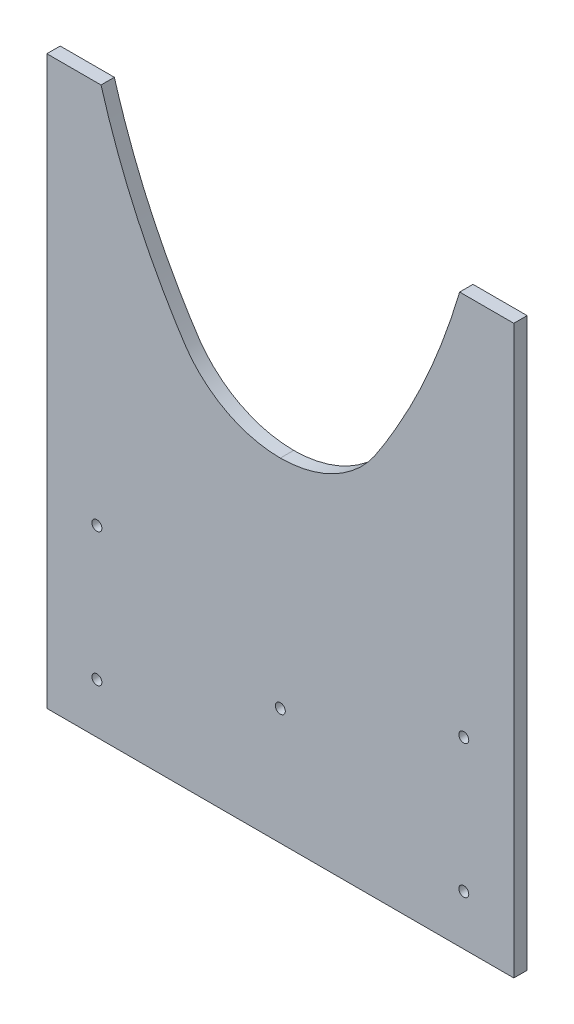
ISO-10303-21;
HEADER;
FILE_DESCRIPTION(('STEP AP214'),'2;1');
FILE_NAME('part.step','',(''),(''),'','','');
FILE_SCHEMA(('AUTOMOTIVE_DESIGN { 1 0 10303 214 1 1 1 1 }'));
ENDSEC;
DATA;
#1=APPLICATION_CONTEXT('core data for automotive mechanical design processes');
#2=APPLICATION_PROTOCOL_DEFINITION('international standard','automotive_design',2000,#1);
#3=PRODUCT_CONTEXT('',#1,'mechanical');
#4=PRODUCT('Part','Part','',(#3));
#5=PRODUCT_RELATED_PRODUCT_CATEGORY('part','',(#4));
#6=PRODUCT_DEFINITION_FORMATION('','',#4);
#7=PRODUCT_DEFINITION_CONTEXT('part definition',#1,'design');
#8=PRODUCT_DEFINITION('design','',#6,#7);
#9=PRODUCT_DEFINITION_SHAPE('','',#8);
#10=(LENGTH_UNIT() NAMED_UNIT(*) SI_UNIT(.MILLI.,.METRE.));
#11=(NAMED_UNIT(*) PLANE_ANGLE_UNIT() SI_UNIT($,.RADIAN.));
#12=(NAMED_UNIT(*) SI_UNIT($,.STERADIAN.) SOLID_ANGLE_UNIT());
#13=UNCERTAINTY_MEASURE_WITH_UNIT(LENGTH_MEASURE(1.E-05),#10,'distance_accuracy_value','');
#14=(GEOMETRIC_REPRESENTATION_CONTEXT(3) GLOBAL_UNCERTAINTY_ASSIGNED_CONTEXT((#13)) GLOBAL_UNIT_ASSIGNED_CONTEXT((#10,
#11,#12)) REPRESENTATION_CONTEXT('',''));
#15=CARTESIAN_POINT('',(0.,0.,0.));
#16=DIRECTION('',(0.,0.,1.));
#17=DIRECTION('',(1.,0.,0.));
#18=AXIS2_PLACEMENT_3D('',#15,#16,#17);
#19=CARTESIAN_POINT('',(68.2776648384723,-76.2788164399899,1785.62));
#20=CARTESIAN_POINT('',(66.3580377716615,-82.809925819806,1785.62));
#21=CARTESIAN_POINT('',(64.1931728528322,-89.2930332015323,1785.62));
#22=CARTESIAN_POINT('',(61.0505925062542,-97.6520891564207,1785.62));
#23=CARTESIAN_POINT('',(60.3031566909286,-99.5750173457487,1785.62));
#24=CARTESIAN_POINT('',(58.7656954371436,-103.402745234526,1785.62));
#25=CARTESIAN_POINT('',(57.9779989588845,-105.307253065276,1785.62));
#26=CARTESIAN_POINT('',(55.5359874824274,-110.98184323593,1785.62));
#27=CARTESIAN_POINT('',(53.8110889481545,-114.717105752996,1785.62));
#28=CARTESIAN_POINT('',(50.1870863601385,-122.101692823934,1785.62));
#29=CARTESIAN_POINT('',(48.2864949272062,-125.750283633326,1785.62));
#30=CARTESIAN_POINT('',(45.3042831918309,-131.158385634661,1785.62));
#31=CARTESIAN_POINT('',(44.2887270005921,-132.950487155397,1785.62));
#32=CARTESIAN_POINT('',(42.2117934578612,-136.51208599239,1785.62));
#33=CARTESIAN_POINT('',(41.151561944254,-138.283463920776,1785.62));
#34=CARTESIAN_POINT('',(38.9901136188299,-141.791224850873,1785.62));
#35=CARTESIAN_POINT('',(37.8904748888144,-143.53042440295,1785.62));
#36=CARTESIAN_POINT('',(36.4775745879245,-145.674656271504,1785.62));
#37=CARTESIAN_POINT('',(36.1939533748053,-146.102694533907,1785.62));
#38=CARTESIAN_POINT('',(35.6118016130174,-146.947198885048,1785.62));
#39=CARTESIAN_POINT('',(35.3131484957358,-147.363569839748,1785.62));
#40=CARTESIAN_POINT('',(34.3937117171203,-148.594460237871,1785.62));
#41=CARTESIAN_POINT('',(33.7496252006165,-149.390892712492,1785.62));
#42=CARTESIAN_POINT('',(31.7321097453987,-151.714017090373,1785.62));
#43=CARTESIAN_POINT('',(30.268475215956,-153.17069415239,1785.62));
#44=CARTESIAN_POINT('',(27.892154672459,-155.215324912634,1785.62));
#45=CARTESIAN_POINT('',(27.0680272486616,-155.873986647449,1785.62));
#46=CARTESIAN_POINT('',(25.3899539225398,-157.118601063591,1785.62));
#47=CARTESIAN_POINT('',(24.5323783720882,-157.707958327615,1785.62));
#48=CARTESIAN_POINT('',(21.9058498706455,-159.38040582937,1785.62));
#49=CARTESIAN_POINT('',(20.082969030761,-160.367647762716,1785.62));
#50=CARTESIAN_POINT('',(17.2409107496496,-161.657025124886,1785.62));
#51=CARTESIAN_POINT('',(16.2755171664848,-162.054752866045,1785.62));
#52=CARTESIAN_POINT('',(14.7996452324783,-162.601967144406,1785.62));
#53=CARTESIAN_POINT('',(14.3031758809108,-162.776035774068,1785.62));
#54=CARTESIAN_POINT('',(13.3090026265997,-163.104947844653,1785.62));
#55=CARTESIAN_POINT('',(12.8103056195177,-163.260187415128,1785.62));
#56=CARTESIAN_POINT('',(10.3088430346787,-163.990728461663,1785.62));
#57=CARTESIAN_POINT('',(8.28226290769136,-164.429735420196,1785.62));
#58=CARTESIAN_POINT('',(4.17915831627532,-165.021909815007,1785.62));
#59=CARTESIAN_POINT('',(2.10263288128114,-165.175071696583,1785.62));
#60=CARTESIAN_POINT('',(0.,-165.178816439875,1785.62));
#61=B_SPLINE_CURVE_WITH_KNOTS('',3,(#19,#20,#21,#22,#23,#24,#25,#26,#27,#28,#29,#30,#31,#32,#33,
#34,#35,#36,#37,#38,#39,#40,#41,#42,#43,#44,#45,#46,#47,#48,#49,#50,#51,#52,#53,#54,#55,#56,#57,
#58,#59,#60),.UNSPECIFIED.,.F.,.F.,(4,2,2,2,2,2,2,2,2,2,2,2,2,2,2,2,2,2,2,2,4),
(0.395594902462267,0.5,0.53125,0.5625,0.625,0.6875,0.71875,0.749999999999999,0.781249999999999,
0.789062499999999,0.796874999999999,0.812499999999999,0.843749999999999,0.859374999999999,
0.874999999999999,0.90625,0.921875,0.9296875,0.9375,0.96875,1.),.UNSPECIFIED.);
#62=DIRECTION('',(0.,0.,1.));
#63=VECTOR('',#62,1.);
#64=SURFACE_OF_LINEAR_EXTRUSION('',#61,#63);
#65=CARTESIAN_POINT('',(0.,-165.178816439875,1790.7));
#66=CARTESIAN_POINT('',(2.10263288128114,-165.175071696583,1790.7));
#67=CARTESIAN_POINT('',(4.17915831627532,-165.021909815007,1790.7));
#68=CARTESIAN_POINT('',(8.28226290769136,-164.429735420196,1790.7));
#69=CARTESIAN_POINT('',(10.3088430346787,-163.990728461663,1790.7));
#70=CARTESIAN_POINT('',(12.8103056195177,-163.260187415128,1790.7));
#71=CARTESIAN_POINT('',(13.3090026265997,-163.104947844653,1790.7));
#72=CARTESIAN_POINT('',(14.3031758809108,-162.776035774068,1790.7));
#73=CARTESIAN_POINT('',(14.7996452324783,-162.601967144406,1790.7));
#74=CARTESIAN_POINT('',(16.2755171664848,-162.054752866045,1790.7));
#75=CARTESIAN_POINT('',(17.2409107496496,-161.657025124886,1790.7));
#76=CARTESIAN_POINT('',(20.082969030761,-160.367647762716,1790.7));
#77=CARTESIAN_POINT('',(21.9058498706455,-159.38040582937,1790.7));
#78=CARTESIAN_POINT('',(24.5323783720882,-157.707958327615,1790.7));
#79=CARTESIAN_POINT('',(25.3899539225398,-157.118601063591,1790.7));
#80=CARTESIAN_POINT('',(27.0680272486616,-155.873986647449,1790.7));
#81=CARTESIAN_POINT('',(27.892154672459,-155.215324912634,1790.7));
#82=CARTESIAN_POINT('',(30.268475215956,-153.17069415239,1790.7));
#83=CARTESIAN_POINT('',(31.7321097453987,-151.714017090373,1790.7));
#84=CARTESIAN_POINT('',(33.7496252006165,-149.390892712492,1790.7));
#85=CARTESIAN_POINT('',(34.3937117171203,-148.594460237871,1790.7));
#86=CARTESIAN_POINT('',(35.3131484957358,-147.363569839748,1790.7));
#87=CARTESIAN_POINT('',(35.6118016130174,-146.947198885048,1790.7));
#88=CARTESIAN_POINT('',(36.1939533748053,-146.102694533907,1790.7));
#89=CARTESIAN_POINT('',(36.4775745879245,-145.674656271504,1790.7));
#90=CARTESIAN_POINT('',(37.8904748888144,-143.53042440295,1790.7));
#91=CARTESIAN_POINT('',(38.9901136188299,-141.791224850873,1790.7));
#92=CARTESIAN_POINT('',(41.151561944254,-138.283463920776,1790.7));
#93=CARTESIAN_POINT('',(42.2117934578612,-136.51208599239,1790.7));
#94=CARTESIAN_POINT('',(44.2887270005921,-132.950487155397,1790.7));
#95=CARTESIAN_POINT('',(45.3042831918309,-131.158385634661,1790.7));
#96=CARTESIAN_POINT('',(48.2864949272062,-125.750283633326,1790.7));
#97=CARTESIAN_POINT('',(50.1870863601385,-122.101692823934,1790.7));
#98=CARTESIAN_POINT('',(53.8110889481545,-114.717105752996,1790.7));
#99=CARTESIAN_POINT('',(55.5359874824274,-110.98184323593,1790.7));
#100=CARTESIAN_POINT('',(57.9779989588845,-105.307253065276,1790.7));
#101=CARTESIAN_POINT('',(58.7656954371436,-103.402745234526,1790.7));
#102=CARTESIAN_POINT('',(60.3031566909286,-99.5750173457487,1790.7));
#103=CARTESIAN_POINT('',(61.0505925062542,-97.6520891564207,1790.7));
#104=CARTESIAN_POINT('',(64.1931728528322,-89.2930332015323,1790.7));
#105=CARTESIAN_POINT('',(66.3580377716615,-82.809925819806,1790.7));
#106=CARTESIAN_POINT('',(68.2776648384723,-76.2788164399899,1790.7));
#107=B_SPLINE_CURVE_WITH_KNOTS('',3,(#65,#66,#67,#68,#69,#70,#71,#72,#73,#74,#75,#76,#77,#78,
#79,#80,#81,#82,#83,#84,#85,#86,#87,#88,#89,#90,#91,#92,#93,#94,#95,#96,#97,#98,#99,#100,#101,
#102,#103,#104,#105,#106),.UNSPECIFIED.,.F.,.F.,(4,2,2,2,2,2,2,2,2,2,2,2,2,2,2,2,2,2,2,2,4),
(0.395594902462267,0.426844902462267,0.458094902462266,0.465907402462266,0.473719902462266,
0.489344902462267,0.520594902462267,0.536219902462267,0.551844902462267,0.583094902462268,
0.598719902462268,0.606532402462267,0.614344902462267,0.645594902462267,0.676844902462267,
0.708094902462267,0.770594902462267,0.833094902462267,0.864344902462267,0.895594902462266,1.),.UNSPECIFIED.);
#108=CARTESIAN_POINT('',(68.2776648384727,-76.2788164399883,1790.7));
#109=VERTEX_POINT('',#108);
#110=CARTESIAN_POINT('',(0.,-165.178816439988,1790.7));
#111=VERTEX_POINT('',#110);
#112=EDGE_CURVE('E241',#109,#111,#107,.F.);
#113=ORIENTED_EDGE('',*,*,#112,.F.);
#114=DIRECTION('',(0.,0.,1.));
#115=VECTOR('',#114,1.);
#116=CARTESIAN_POINT('',(68.2776648384727,-76.2788164399883,1785.62));
#117=LINE('',#116,#115);
#118=CARTESIAN_POINT('',(68.2776648384727,-76.2788164399883,1785.62));
#119=VERTEX_POINT('',#118);
#120=EDGE_CURVE('E11',#119,#109,#117,.T.);
#121=ORIENTED_EDGE('',*,*,#120,.F.);
#122=CARTESIAN_POINT('',(68.2776648384723,-76.2788164399899,1785.62));
#123=CARTESIAN_POINT('',(66.3580377716615,-82.809925819806,1785.62));
#124=CARTESIAN_POINT('',(64.1931728528322,-89.2930332015323,1785.62));
#125=CARTESIAN_POINT('',(61.0505925062542,-97.6520891564207,1785.62));
#126=CARTESIAN_POINT('',(60.3031566909286,-99.5750173457487,1785.62));
#127=CARTESIAN_POINT('',(58.7656954371436,-103.402745234526,1785.62));
#128=CARTESIAN_POINT('',(57.9779989588845,-105.307253065276,1785.62));
#129=CARTESIAN_POINT('',(55.5359874824274,-110.98184323593,1785.62));
#130=CARTESIAN_POINT('',(53.8110889481545,-114.717105752996,1785.62));
#131=CARTESIAN_POINT('',(50.1870863601385,-122.101692823934,1785.62));
#132=CARTESIAN_POINT('',(48.2864949272062,-125.750283633326,1785.62));
#133=CARTESIAN_POINT('',(45.3042831918309,-131.158385634661,1785.62));
#134=CARTESIAN_POINT('',(44.2887270005921,-132.950487155397,1785.62));
#135=CARTESIAN_POINT('',(42.2117934578612,-136.51208599239,1785.62));
#136=CARTESIAN_POINT('',(41.151561944254,-138.283463920776,1785.62));
#137=CARTESIAN_POINT('',(38.9901136188299,-141.791224850873,1785.62));
#138=CARTESIAN_POINT('',(37.8904748888144,-143.53042440295,1785.62));
#139=CARTESIAN_POINT('',(36.4775745879245,-145.674656271504,1785.62));
#140=CARTESIAN_POINT('',(36.1939533748053,-146.102694533907,1785.62));
#141=CARTESIAN_POINT('',(35.6118016130174,-146.947198885048,1785.62));
#142=CARTESIAN_POINT('',(35.3131484957358,-147.363569839748,1785.62));
#143=CARTESIAN_POINT('',(34.3937117171203,-148.594460237871,1785.62));
#144=CARTESIAN_POINT('',(33.7496252006165,-149.390892712492,1785.62));
#145=CARTESIAN_POINT('',(31.7321097453987,-151.714017090373,1785.62));
#146=CARTESIAN_POINT('',(30.268475215956,-153.17069415239,1785.62));
#147=CARTESIAN_POINT('',(27.892154672459,-155.215324912634,1785.62));
#148=CARTESIAN_POINT('',(27.0680272486616,-155.873986647449,1785.62));
#149=CARTESIAN_POINT('',(25.3899539225398,-157.118601063591,1785.62));
#150=CARTESIAN_POINT('',(24.5323783720882,-157.707958327615,1785.62));
#151=CARTESIAN_POINT('',(21.9058498706455,-159.38040582937,1785.62));
#152=CARTESIAN_POINT('',(20.082969030761,-160.367647762716,1785.62));
#153=CARTESIAN_POINT('',(17.2409107496496,-161.657025124886,1785.62));
#154=CARTESIAN_POINT('',(16.2755171664848,-162.054752866045,1785.62));
#155=CARTESIAN_POINT('',(14.7996452324783,-162.601967144406,1785.62));
#156=CARTESIAN_POINT('',(14.3031758809108,-162.776035774068,1785.62));
#157=CARTESIAN_POINT('',(13.3090026265997,-163.104947844653,1785.62));
#158=CARTESIAN_POINT('',(12.8103056195177,-163.260187415128,1785.62));
#159=CARTESIAN_POINT('',(10.3088430346787,-163.990728461663,1785.62));
#160=CARTESIAN_POINT('',(8.28226290769136,-164.429735420196,1785.62));
#161=CARTESIAN_POINT('',(4.17915831627532,-165.021909815007,1785.62));
#162=CARTESIAN_POINT('',(2.10263288128114,-165.175071696583,1785.62));
#163=CARTESIAN_POINT('',(0.,-165.178816439875,1785.62));
#164=B_SPLINE_CURVE_WITH_KNOTS('',3,(#122,#123,#124,#125,#126,#127,#128,#129,#130,#131,#132,
#133,#134,#135,#136,#137,#138,#139,#140,#141,#142,#143,#144,#145,#146,#147,#148,#149,#150,#151,
#152,#153,#154,#155,#156,#157,#158,#159,#160,#161,#162,#163),.UNSPECIFIED.,.F.,.F.,(4,2,2,2,2,2,
2,2,2,2,2,2,2,2,2,2,2,2,2,2,4),(0.395594902462267,0.5,0.53125,0.5625,0.625,0.6875,0.71875,
0.749999999999999,0.781249999999999,0.789062499999999,0.796874999999999,0.812499999999999,
0.843749999999999,0.859374999999999,0.874999999999999,0.90625,0.921875,0.9296875,0.9375,0.96875,
1.),.UNSPECIFIED.);
#165=CARTESIAN_POINT('',(0.,-165.178816439988,1785.62));
#166=VERTEX_POINT('',#165);
#167=EDGE_CURVE('E191',#119,#166,#164,.T.);
#168=ORIENTED_EDGE('',*,*,#167,.T.);
#169=DIRECTION('',(0.,0.,1.));
#170=VECTOR('',#169,1.);
#171=CARTESIAN_POINT('',(0.,-165.178816439988,1785.62));
#172=LINE('',#171,#170);
#173=EDGE_CURVE('E95',#166,#111,#172,.T.);
#174=ORIENTED_EDGE('',*,*,#173,.T.);
#175=EDGE_LOOP('',(#113,#121,#168,#174));
#176=FACE_BOUND('',#175,.T.);
#177=ADVANCED_FACE('F39',(#176),#64,.T.);
#178=CARTESIAN_POINT('',(68.2776648384727,-76.2788164399883,1785.62));
#179=DIRECTION('',(0.,-1.,0.));
#180=DIRECTION('',(1.,0.,0.));
#181=AXIS2_PLACEMENT_3D('',#178,#179,#180);
#182=PLANE('',#181);
#183=DIRECTION('',(1.,0.,0.));
#184=VECTOR('',#183,1.);
#185=CARTESIAN_POINT('',(68.2776648384727,-76.2788164399883,1790.7));
#186=LINE('',#185,#184);
#187=CARTESIAN_POINT('',(88.8999999999999,-76.2788164399883,1790.7));
#188=VERTEX_POINT('',#187);
#189=EDGE_CURVE('E86',#109,#188,#186,.T.);
#190=ORIENTED_EDGE('',*,*,#189,.T.);
#191=DIRECTION('',(0.,0.,1.));
#192=VECTOR('',#191,1.);
#193=CARTESIAN_POINT('',(88.8999999999999,-76.2788164399883,1785.62));
#194=LINE('',#193,#192);
#195=CARTESIAN_POINT('',(88.8999999999999,-76.2788164399883,1785.62));
#196=VERTEX_POINT('',#195);
#197=EDGE_CURVE('E50',#196,#188,#194,.T.);
#198=ORIENTED_EDGE('',*,*,#197,.F.);
#199=DIRECTION('',(1.,0.,0.));
#200=VECTOR('',#199,1.);
#201=CARTESIAN_POINT('',(68.2776648384727,-76.2788164399883,1785.62));
#202=LINE('',#201,#200);
#203=EDGE_CURVE('E118',#119,#196,#202,.T.);
#204=ORIENTED_EDGE('',*,*,#203,.F.);
#205=ORIENTED_EDGE('',*,*,#120,.T.);
#206=EDGE_LOOP('',(#190,#198,#204,#205));
#207=FACE_BOUND('',#206,.T.);
#208=ADVANCED_FACE('F226',(#207),#182,.F.);
#209=CARTESIAN_POINT('',(88.8999999999999,-76.2788164399883,1785.62));
#210=DIRECTION('',(-1.,0.,0.));
#211=DIRECTION('',(0.,-1.,0.));
#212=AXIS2_PLACEMENT_3D('',#209,#210,#211);
#213=PLANE('',#212);
#214=DIRECTION('',(0.,-1.,0.));
#215=VECTOR('',#214,1.);
#216=CARTESIAN_POINT('',(88.8999999999999,-76.2788164399883,1790.7));
#217=LINE('',#216,#215);
#218=CARTESIAN_POINT('',(88.8999999999999,-292.178816439988,1790.7));
#219=VERTEX_POINT('',#218);
#220=EDGE_CURVE('E125',#188,#219,#217,.T.);
#221=ORIENTED_EDGE('',*,*,#220,.T.);
#222=DIRECTION('',(0.,0.,1.));
#223=VECTOR('',#222,1.);
#224=CARTESIAN_POINT('',(88.8999999999999,-292.178816439988,1785.62));
#225=LINE('',#224,#223);
#226=CARTESIAN_POINT('',(88.8999999999999,-292.178816439988,1785.62));
#227=VERTEX_POINT('',#226);
#228=EDGE_CURVE('E122',#227,#219,#225,.T.);
#229=ORIENTED_EDGE('',*,*,#228,.F.);
#230=DIRECTION('',(0.,-1.,0.));
#231=VECTOR('',#230,1.);
#232=CARTESIAN_POINT('',(88.8999999999999,-203.278816439988,1785.62));
#233=LINE('',#232,#231);
#234=EDGE_CURVE('E111',#196,#227,#233,.T.);
#235=ORIENTED_EDGE('',*,*,#234,.F.);
#236=ORIENTED_EDGE('',*,*,#197,.T.);
#237=EDGE_LOOP('',(#221,#229,#235,#236));
#238=FACE_BOUND('',#237,.T.);
#239=ADVANCED_FACE('F123',(#238),#213,.F.);
#240=CARTESIAN_POINT('',(88.8999999999999,-292.178816439988,1785.62));
#241=DIRECTION('',(0.,1.,0.));
#242=DIRECTION('',(-1.,0.,0.));
#243=AXIS2_PLACEMENT_3D('',#240,#241,#242);
#244=PLANE('',#243);
#245=DIRECTION('',(-1.,0.,0.));
#246=VECTOR('',#245,1.);
#247=CARTESIAN_POINT('',(88.8999999999999,-292.178816439988,1790.7));
#248=LINE('',#247,#246);
#249=CARTESIAN_POINT('',(-88.9,-292.178816439988,1790.7));
#250=VERTEX_POINT('',#249);
#251=EDGE_CURVE('E144',#219,#250,#248,.T.);
#252=ORIENTED_EDGE('',*,*,#251,.T.);
#253=DIRECTION('',(0.,0.,1.));
#254=VECTOR('',#253,1.);
#255=CARTESIAN_POINT('',(-88.9,-292.178816439988,1785.62));
#256=LINE('',#255,#254);
#257=CARTESIAN_POINT('',(-88.9,-292.178816439988,1785.62));
#258=VERTEX_POINT('',#257);
#259=EDGE_CURVE('E128',#258,#250,#256,.T.);
#260=ORIENTED_EDGE('',*,*,#259,.F.);
#261=DIRECTION('',(-1.,0.,0.));
#262=VECTOR('',#261,1.);
#263=CARTESIAN_POINT('',(88.8999999999999,-292.178816439988,1785.62));
#264=LINE('',#263,#262);
#265=EDGE_CURVE('E116',#227,#258,#264,.T.);
#266=ORIENTED_EDGE('',*,*,#265,.F.);
#267=ORIENTED_EDGE('',*,*,#228,.T.);
#268=EDGE_LOOP('',(#252,#260,#266,#267));
#269=FACE_BOUND('',#268,.T.);
#270=ADVANCED_FACE('F130',(#269),#244,.F.);
#271=CARTESIAN_POINT('',(-88.9,-292.178816439988,1785.62));
#272=DIRECTION('',(1.,0.,0.));
#273=DIRECTION('',(0.,1.,0.));
#274=AXIS2_PLACEMENT_3D('',#271,#272,#273);
#275=PLANE('',#274);
#276=DIRECTION('',(0.,1.,0.));
#277=VECTOR('',#276,1.);
#278=CARTESIAN_POINT('',(-88.9,-292.178816439988,1790.7));
#279=LINE('',#278,#277);
#280=CARTESIAN_POINT('',(-88.8999999999999,-203.278816439986,1790.7));
#281=VERTEX_POINT('',#280);
#282=EDGE_CURVE('E141',#250,#281,#279,.T.);
#283=ORIENTED_EDGE('',*,*,#282,.T.);
#284=DIRECTION('',(0.,0.,1.));
#285=VECTOR('',#284,1.);
#286=CARTESIAN_POINT('',(-88.8999999999999,-203.278816439986,1785.62));
#287=LINE('',#286,#285);
#288=CARTESIAN_POINT('',(-88.8999999999999,-203.278816439986,1785.62));
#289=VERTEX_POINT('',#288);
#290=EDGE_CURVE('E149',#289,#281,#287,.T.);
#291=ORIENTED_EDGE('',*,*,#290,.F.);
#292=DIRECTION('',(0.,1.,0.));
#293=VECTOR('',#292,1.);
#294=CARTESIAN_POINT('',(-88.9,-292.178816439988,1785.62));
#295=LINE('',#294,#293);
#296=EDGE_CURVE('E133',#258,#289,#295,.T.);
#297=ORIENTED_EDGE('',*,*,#296,.F.);
#298=ORIENTED_EDGE('',*,*,#259,.T.);
#299=EDGE_LOOP('',(#283,#291,#297,#298));
#300=FACE_BOUND('',#299,.T.);
#301=ADVANCED_FACE('F315',(#300),#275,.F.);
#302=CARTESIAN_POINT('',(-88.8999999999999,-203.278816439986,1785.62));
#303=DIRECTION('',(0.999999999999982,-1.87885869919989E-07,0.));
#304=DIRECTION('',(1.87885869919989E-07,0.999999999999982,0.));
#305=AXIS2_PLACEMENT_3D('',#302,#303,#304);
#306=PLANE('',#305);
#307=DIRECTION('',(1.87885869919989E-07,0.999999999999982,0.));
#308=VECTOR('',#307,1.);
#309=CARTESIAN_POINT('',(-88.8999999999999,-203.278816439986,1790.7));
#310=LINE('',#309,#308);
#311=CARTESIAN_POINT('',(-88.8999761384945,-76.2788164399883,1790.7));
#312=VERTEX_POINT('',#311);
#313=EDGE_CURVE('E139',#281,#312,#310,.T.);
#314=ORIENTED_EDGE('',*,*,#313,.T.);
#315=DIRECTION('',(0.,0.,1.));
#316=VECTOR('',#315,1.);
#317=CARTESIAN_POINT('',(-88.8999761384945,-76.2788164399883,1785.62));
#318=LINE('',#317,#316);
#319=CARTESIAN_POINT('',(-88.8999761384945,-76.2788164399883,1785.62));
#320=VERTEX_POINT('',#319);
#321=EDGE_CURVE('E152',#320,#312,#318,.T.);
#322=ORIENTED_EDGE('',*,*,#321,.F.);
#323=DIRECTION('',(1.87885869919989E-07,0.999999999999982,0.));
#324=VECTOR('',#323,1.);
#325=CARTESIAN_POINT('',(-88.8999999999999,-203.278816439986,1785.62));
#326=LINE('',#325,#324);
#327=EDGE_CURVE('E135',#289,#320,#326,.T.);
#328=ORIENTED_EDGE('',*,*,#327,.F.);
#329=ORIENTED_EDGE('',*,*,#290,.T.);
#330=EDGE_LOOP('',(#314,#322,#328,#329));
#331=FACE_BOUND('',#330,.T.);
#332=ADVANCED_FACE('F312',(#331),#306,.F.);
#333=CARTESIAN_POINT('',(-88.8999761384945,-76.2788164399883,1785.62));
#334=DIRECTION('',(0.,-1.,0.));
#335=DIRECTION('',(0.,0.,-1.));
#336=AXIS2_PLACEMENT_3D('',#333,#334,#335);
#337=PLANE('',#336);
#338=DIRECTION('',(1.,0.,0.));
#339=VECTOR('',#338,1.);
#340=CARTESIAN_POINT('',(-88.8999761384945,-76.2788164399883,1790.7));
#341=LINE('',#340,#339);
#342=CARTESIAN_POINT('',(-68.2776409769904,-76.2788164399097,1790.7));
#343=VERTEX_POINT('',#342);
#344=EDGE_CURVE('E142',#312,#343,#341,.T.);
#345=ORIENTED_EDGE('',*,*,#344,.T.);
#346=DIRECTION('',(0.,0.,1.));
#347=VECTOR('',#346,1.);
#348=CARTESIAN_POINT('',(-68.2776409769904,-76.2788164399097,1785.62));
#349=LINE('',#348,#347);
#350=CARTESIAN_POINT('',(-68.2776409769904,-76.2788164399097,1785.62));
#351=VERTEX_POINT('',#350);
#352=EDGE_CURVE('E155',#351,#343,#349,.T.);
#353=ORIENTED_EDGE('',*,*,#352,.F.);
#354=DIRECTION('',(1.,0.,0.));
#355=VECTOR('',#354,1.);
#356=CARTESIAN_POINT('',(-88.8999761384945,-76.2788164399883,1785.62));
#357=LINE('',#356,#355);
#358=EDGE_CURVE('E185',#320,#351,#357,.T.);
#359=ORIENTED_EDGE('',*,*,#358,.F.);
#360=ORIENTED_EDGE('',*,*,#321,.T.);
#361=EDGE_LOOP('',(#345,#353,#359,#360));
#362=FACE_BOUND('',#361,.T.);
#363=ADVANCED_FACE('F172',(#362),#337,.F.);
#364=CARTESIAN_POINT('',(0.,-165.178816439988,1785.62));
#365=CARTESIAN_POINT('',(-2.07617973458294,-165.175118809173,1785.62));
#366=CARTESIAN_POINT('',(-4.1272675065838,-165.025715701066,1785.62));
#367=CARTESIAN_POINT('',(-8.18138470157388,-164.44784145053,1785.62));
#368=CARTESIAN_POINT('',(-10.1844130471057,-164.019364051402,1785.62));
#369=CARTESIAN_POINT('',(-12.6576457416275,-163.306351878403,1785.62));
#370=CARTESIAN_POINT('',(-13.1507568100589,-163.154833183972,1785.62));
#371=CARTESIAN_POINT('',(-14.1338813250615,-162.833808343156,1785.62));
#372=CARTESIAN_POINT('',(-14.6248638583258,-162.663927930732,1785.62));
#373=CARTESIAN_POINT('',(-16.0843680750154,-162.129978817494,1785.62));
#374=CARTESIAN_POINT('',(-17.0394655442247,-161.741851533403,1785.62));
#375=CARTESIAN_POINT('',(-19.8523823751898,-160.483393742539,1785.62));
#376=CARTESIAN_POINT('',(-21.6581940429901,-159.519648080565,1785.62));
#377=CARTESIAN_POINT('',(-24.2627445116377,-157.886926895302,1785.62));
#378=CARTESIAN_POINT('',(-25.1135647534618,-157.311498990104,1785.62));
#379=CARTESIAN_POINT('',(-26.363032726323,-156.400287075484,1785.62));
#380=CARTESIAN_POINT('',(-26.7750336462129,-156.088487790517,1785.62));
#381=CARTESIAN_POINT('',(-27.5899336601617,-155.448540707355,1785.62));
#382=CARTESIAN_POINT('',(-27.9928166936473,-155.120302485302,1785.62));
#383=CARTESIAN_POINT('',(-29.9678516675857,-153.451497786196,1785.62));
#384=CARTESIAN_POINT('',(-31.4369141702495,-152.018948482733,1785.62));
#385=CARTESIAN_POINT('',(-33.4725061319942,-149.722501080188,1785.62));
#386=CARTESIAN_POINT('',(-34.1239447731139,-148.933212817086,1785.62));
#387=CARTESIAN_POINT('',(-35.0575911074559,-147.711046684915,1785.62));
#388=CARTESIAN_POINT('',(-35.361355293739,-147.297110541263,1785.62));
#389=CARTESIAN_POINT('',(-35.954067754547,-146.456219488266,1785.62));
#390=CARTESIAN_POINT('',(-36.2415977847808,-146.028018365362,1785.62));
#391=CARTESIAN_POINT('',(-37.0982070346207,-144.738159622084,1785.62));
#392=CARTESIAN_POINT('',(-37.6597151015689,-143.86912670545,1785.62));
#393=CARTESIAN_POINT('',(-38.7714138124585,-142.127882651508,1785.62));
#394=CARTESIAN_POINT('',(-39.3192114529292,-141.253369022358,1785.62));
#395=CARTESIAN_POINT('',(-42.0312943960402,-136.867796868658,1785.62));
#396=CARTESIAN_POINT('',(-44.1081663693142,-133.314489220265,1785.62));
#397=CARTESIAN_POINT('',(-48.0872043290224,-126.123433999643,1785.62));
#398=CARTESIAN_POINT('',(-49.9900501033977,-122.486014986514,1785.62));
#399=CARTESIAN_POINT('',(-53.618282208829,-115.125406219658,1785.62));
#400=CARTESIAN_POINT('',(-55.3449635762511,-111.402842390515,1785.62));
#401=CARTESIAN_POINT('',(-57.7916945949896,-105.749740383286,1785.62));
#402=CARTESIAN_POINT('',(-58.5806223350856,-103.852492767681,1785.62));
#403=CARTESIAN_POINT('',(-60.1200914665329,-100.039444420902,1785.62));
#404=CARTESIAN_POINT('',(-61.6181395723498,-96.2063762206954,1785.62));
#405=CARTESIAN_POINT('',(-63.0331944874633,-92.3331952640296,1785.62));
#406=CARTESIAN_POINT('',(-64.4065808772548,-88.4398748309311,1785.62));
#407=CARTESIAN_POINT('',(-65.0725074352541,-86.482752568832,1785.62));
#408=CARTESIAN_POINT('',(-66.6135707223556,-81.7830742581749,1785.62));
#409=CARTESIAN_POINT('',(-67.4675901804791,-79.0347362074539,1785.62));
#410=CARTESIAN_POINT('',(-68.2776409769904,-76.2788164399097,1785.62));
#411=B_SPLINE_CURVE_WITH_KNOTS('',3,(#364,#365,#366,#367,#368,#369,#370,#371,#372,#373,#374,
#375,#376,#377,#378,#379,#380,#381,#382,#383,#384,#385,#386,#387,#388,#389,#390,#391,#392,#393,
#394,#395,#396,#397,#398,#399,#400,#401,#402,#403,#404,#405,#406,#407,#408,#409,#410),
.UNSPECIFIED.,.F.,.F.,(4,2,2,2,2,2,2,2,2,2,2,2,2,2,2,2,2,2,2,2,1,2,2,4),(0.,0.0312500000000006,
0.0625000000000012,0.0703125000000012,0.0781250000000013,0.0937500000000013,0.125000000000001,
0.140625000000001,0.148437500000001,0.156250000000001,0.187500000000001,0.203125,0.2109375,
0.21875,0.234375,0.25,0.3125,0.375,0.437499999999999,0.468749999999999,0.499999999999999,
0.531249999999999,0.562499999999999,0.60621778110331),.UNSPECIFIED.);
#412=DIRECTION('',(0.,0.,1.));
#413=VECTOR('',#412,1.);
#414=SURFACE_OF_LINEAR_EXTRUSION('',#411,#413);
#415=CARTESIAN_POINT('',(-68.2776409769904,-76.2788164399097,1790.7));
#416=CARTESIAN_POINT('',(-67.4675901804791,-79.0347362074539,1790.7));
#417=CARTESIAN_POINT('',(-66.6135707223556,-81.7830742581749,1790.7));
#418=CARTESIAN_POINT('',(-65.0725074352541,-86.482752568832,1790.7));
#419=CARTESIAN_POINT('',(-64.4065808772548,-88.4398748309311,1790.7));
#420=CARTESIAN_POINT('',(-63.0331944874633,-92.3331952640296,1790.7));
#421=CARTESIAN_POINT('',(-61.6181395723498,-96.2063762206954,1790.7));
#422=CARTESIAN_POINT('',(-60.1200914665329,-100.039444420902,1790.7));
#423=CARTESIAN_POINT('',(-58.5806223350856,-103.852492767681,1790.7));
#424=CARTESIAN_POINT('',(-57.7916945949896,-105.749740383286,1790.7));
#425=CARTESIAN_POINT('',(-55.3449635762511,-111.402842390515,1790.7));
#426=CARTESIAN_POINT('',(-53.618282208829,-115.125406219658,1790.7));
#427=CARTESIAN_POINT('',(-49.9900501033977,-122.486014986514,1790.7));
#428=CARTESIAN_POINT('',(-48.0872043290224,-126.123433999643,1790.7));
#429=CARTESIAN_POINT('',(-44.1081663693142,-133.314489220265,1790.7));
#430=CARTESIAN_POINT('',(-42.0312943960402,-136.867796868658,1790.7));
#431=CARTESIAN_POINT('',(-39.3192114529292,-141.253369022358,1790.7));
#432=CARTESIAN_POINT('',(-38.7714138124585,-142.127882651508,1790.7));
#433=CARTESIAN_POINT('',(-37.6597151015689,-143.86912670545,1790.7));
#434=CARTESIAN_POINT('',(-37.0982070346207,-144.738159622084,1790.7));
#435=CARTESIAN_POINT('',(-36.2415977847808,-146.028018365362,1790.7));
#436=CARTESIAN_POINT('',(-35.954067754547,-146.456219488266,1790.7));
#437=CARTESIAN_POINT('',(-35.361355293739,-147.297110541263,1790.7));
#438=CARTESIAN_POINT('',(-35.0575911074559,-147.711046684915,1790.7));
#439=CARTESIAN_POINT('',(-34.1239447731139,-148.933212817086,1790.7));
#440=CARTESIAN_POINT('',(-33.4725061319942,-149.722501080188,1790.7));
#441=CARTESIAN_POINT('',(-31.4369141702495,-152.018948482733,1790.7));
#442=CARTESIAN_POINT('',(-29.9678516675857,-153.451497786196,1790.7));
#443=CARTESIAN_POINT('',(-27.9928166936473,-155.120302485302,1790.7));
#444=CARTESIAN_POINT('',(-27.5899336601617,-155.448540707355,1790.7));
#445=CARTESIAN_POINT('',(-26.7750336462129,-156.088487790517,1790.7));
#446=CARTESIAN_POINT('',(-26.363032726323,-156.400287075484,1790.7));
#447=CARTESIAN_POINT('',(-25.1135647534618,-157.311498990104,1790.7));
#448=CARTESIAN_POINT('',(-24.2627445116377,-157.886926895302,1790.7));
#449=CARTESIAN_POINT('',(-21.6581940429901,-159.519648080565,1790.7));
#450=CARTESIAN_POINT('',(-19.8523823751898,-160.483393742539,1790.7));
#451=CARTESIAN_POINT('',(-17.0394655442247,-161.741851533403,1790.7));
#452=CARTESIAN_POINT('',(-16.0843680750154,-162.129978817494,1790.7));
#453=CARTESIAN_POINT('',(-14.6248638583258,-162.663927930732,1790.7));
#454=CARTESIAN_POINT('',(-14.1338813250615,-162.833808343156,1790.7));
#455=CARTESIAN_POINT('',(-13.1507568100589,-163.154833183972,1790.7));
#456=CARTESIAN_POINT('',(-12.6576457416275,-163.306351878403,1790.7));
#457=CARTESIAN_POINT('',(-10.1844130471057,-164.019364051402,1790.7));
#458=CARTESIAN_POINT('',(-8.18138470157388,-164.44784145053,1790.7));
#459=CARTESIAN_POINT('',(-4.1272675065838,-165.025715701066,1790.7));
#460=CARTESIAN_POINT('',(-2.07617973458294,-165.175118809173,1790.7));
#461=CARTESIAN_POINT('',(0.,-165.178816439988,1790.7));
#462=B_SPLINE_CURVE_WITH_KNOTS('',3,(#415,#416,#417,#418,#419,#420,#421,#422,#423,#424,#425,
#426,#427,#428,#429,#430,#431,#432,#433,#434,#435,#436,#437,#438,#439,#440,#441,#442,#443,#444,
#445,#446,#447,#448,#449,#450,#451,#452,#453,#454,#455,#456,#457,#458,#459,#460,#461),
.UNSPECIFIED.,.F.,.F.,(4,2,2,1,2,2,2,2,2,2,2,2,2,2,2,2,2,2,2,2,2,2,2,4),(0.,0.0437177811033111,
0.0749677811033111,0.106217781103311,0.137467781103311,0.168717781103311,0.231217781103311,
0.293717781103311,0.35621778110331,0.37184278110331,0.38746778110331,0.39528028110331,
0.40309278110331,0.41871778110331,0.449967781103309,0.457780281103309,0.465592781103309,
0.481217781103309,0.512467781103309,0.528092781103309,0.535905281103309,0.543717781103309,
0.57496778110331,0.60621778110331),.UNSPECIFIED.);
#463=EDGE_CURVE('E206',#111,#343,#462,.F.);
#464=ORIENTED_EDGE('',*,*,#463,.F.);
#465=ORIENTED_EDGE('',*,*,#173,.F.);
#466=CARTESIAN_POINT('',(0.,-165.178816439988,1785.62));
#467=CARTESIAN_POINT('',(-2.07617973458294,-165.175118809173,1785.62));
#468=CARTESIAN_POINT('',(-4.1272675065838,-165.025715701066,1785.62));
#469=CARTESIAN_POINT('',(-8.18138470157388,-164.44784145053,1785.62));
#470=CARTESIAN_POINT('',(-10.1844130471057,-164.019364051402,1785.62));
#471=CARTESIAN_POINT('',(-12.6576457416275,-163.306351878403,1785.62));
#472=CARTESIAN_POINT('',(-13.1507568100589,-163.154833183972,1785.62));
#473=CARTESIAN_POINT('',(-14.1338813250615,-162.833808343156,1785.62));
#474=CARTESIAN_POINT('',(-14.6248638583258,-162.663927930732,1785.62));
#475=CARTESIAN_POINT('',(-16.0843680750154,-162.129978817494,1785.62));
#476=CARTESIAN_POINT('',(-17.0394655442247,-161.741851533403,1785.62));
#477=CARTESIAN_POINT('',(-19.8523823751898,-160.483393742539,1785.62));
#478=CARTESIAN_POINT('',(-21.6581940429901,-159.519648080565,1785.62));
#479=CARTESIAN_POINT('',(-24.2627445116377,-157.886926895302,1785.62));
#480=CARTESIAN_POINT('',(-25.1135647534618,-157.311498990104,1785.62));
#481=CARTESIAN_POINT('',(-26.363032726323,-156.400287075484,1785.62));
#482=CARTESIAN_POINT('',(-26.7750336462129,-156.088487790517,1785.62));
#483=CARTESIAN_POINT('',(-27.5899336601617,-155.448540707355,1785.62));
#484=CARTESIAN_POINT('',(-27.9928166936473,-155.120302485302,1785.62));
#485=CARTESIAN_POINT('',(-29.9678516675857,-153.451497786196,1785.62));
#486=CARTESIAN_POINT('',(-31.4369141702495,-152.018948482733,1785.62));
#487=CARTESIAN_POINT('',(-33.4725061319942,-149.722501080188,1785.62));
#488=CARTESIAN_POINT('',(-34.1239447731139,-148.933212817086,1785.62));
#489=CARTESIAN_POINT('',(-35.0575911074559,-147.711046684915,1785.62));
#490=CARTESIAN_POINT('',(-35.361355293739,-147.297110541263,1785.62));
#491=CARTESIAN_POINT('',(-35.954067754547,-146.456219488266,1785.62));
#492=CARTESIAN_POINT('',(-36.2415977847808,-146.028018365362,1785.62));
#493=CARTESIAN_POINT('',(-37.0982070346207,-144.738159622084,1785.62));
#494=CARTESIAN_POINT('',(-37.6597151015689,-143.86912670545,1785.62));
#495=CARTESIAN_POINT('',(-38.7714138124585,-142.127882651508,1785.62));
#496=CARTESIAN_POINT('',(-39.3192114529292,-141.253369022358,1785.62));
#497=CARTESIAN_POINT('',(-42.0312943960402,-136.867796868658,1785.62));
#498=CARTESIAN_POINT('',(-44.1081663693142,-133.314489220265,1785.62));
#499=CARTESIAN_POINT('',(-48.0872043290224,-126.123433999643,1785.62));
#500=CARTESIAN_POINT('',(-49.9900501033977,-122.486014986514,1785.62));
#501=CARTESIAN_POINT('',(-53.618282208829,-115.125406219658,1785.62));
#502=CARTESIAN_POINT('',(-55.3449635762511,-111.402842390515,1785.62));
#503=CARTESIAN_POINT('',(-57.7916945949896,-105.749740383286,1785.62));
#504=CARTESIAN_POINT('',(-58.5806223350856,-103.852492767681,1785.62));
#505=CARTESIAN_POINT('',(-60.1200914665329,-100.039444420902,1785.62));
#506=CARTESIAN_POINT('',(-61.6181395723498,-96.2063762206954,1785.62));
#507=CARTESIAN_POINT('',(-63.0331944874633,-92.3331952640296,1785.62));
#508=CARTESIAN_POINT('',(-64.4065808772548,-88.4398748309311,1785.62));
#509=CARTESIAN_POINT('',(-65.0725074352541,-86.482752568832,1785.62));
#510=CARTESIAN_POINT('',(-66.6135707223556,-81.7830742581749,1785.62));
#511=CARTESIAN_POINT('',(-67.4675901804791,-79.0347362074539,1785.62));
#512=CARTESIAN_POINT('',(-68.2776409769904,-76.2788164399097,1785.62));
#513=B_SPLINE_CURVE_WITH_KNOTS('',3,(#466,#467,#468,#469,#470,#471,#472,#473,#474,#475,#476,
#477,#478,#479,#480,#481,#482,#483,#484,#485,#486,#487,#488,#489,#490,#491,#492,#493,#494,#495,
#496,#497,#498,#499,#500,#501,#502,#503,#504,#505,#506,#507,#508,#509,#510,#511,#512),
.UNSPECIFIED.,.F.,.F.,(4,2,2,2,2,2,2,2,2,2,2,2,2,2,2,2,2,2,2,2,1,2,2,4),(0.,0.0312500000000006,
0.0625000000000012,0.0703125000000012,0.0781250000000013,0.0937500000000013,0.125000000000001,
0.140625000000001,0.148437500000001,0.156250000000001,0.187500000000001,0.203125,0.2109375,
0.21875,0.234375,0.25,0.3125,0.375,0.437499999999999,0.468749999999999,0.499999999999999,
0.531249999999999,0.562499999999999,0.60621778110331),.UNSPECIFIED.);
#514=EDGE_CURVE('E157',#166,#351,#513,.T.);
#515=ORIENTED_EDGE('',*,*,#514,.T.);
#516=ORIENTED_EDGE('',*,*,#352,.T.);
#517=EDGE_LOOP('',(#464,#465,#515,#516));
#518=FACE_BOUND('',#517,.T.);
#519=ADVANCED_FACE('F162',(#518),#414,.T.);
#520=CARTESIAN_POINT('',(45.3086101497788,-131.134276505117,1785.62));
#521=DIRECTION('',(0.,0.,1.));
#522=DIRECTION('',(1.,0.,0.));
#523=AXIS2_PLACEMENT_3D('',#520,#521,#522);
#524=PLANE('',#523);
#525=CARTESIAN_POINT('',(0.,-247.728816439988,1785.62));
#526=DIRECTION('',(0.,0.,-1.));
#527=DIRECTION('',(-1.,0.,0.));
#528=AXIS2_PLACEMENT_3D('',#525,#526,#527);
#529=CIRCLE('',#528,1.89864999999999);
#530=CARTESIAN_POINT('',(-1.89864999999999,-247.728816439988,1785.62));
#531=VERTEX_POINT('',#530);
#532=EDGE_CURVE('E428',#531,#531,#529,.T.);
#533=ORIENTED_EDGE('',*,*,#532,.F.);
#534=EDGE_LOOP('',(#533));
#535=FACE_BOUND('',#534,.T.);
#536=CARTESIAN_POINT('',(-69.8500000000001,-222.328816439988,1785.62));
#537=DIRECTION('',(0.,0.,-1.));
#538=DIRECTION('',(-1.,0.,0.));
#539=AXIS2_PLACEMENT_3D('',#536,#537,#538);
#540=CIRCLE('',#539,1.89864999999999);
#541=CARTESIAN_POINT('',(-71.74865,-222.328816439988,1785.62));
#542=VERTEX_POINT('',#541);
#543=EDGE_CURVE('E430',#542,#542,#540,.T.);
#544=ORIENTED_EDGE('',*,*,#543,.F.);
#545=EDGE_LOOP('',(#544));
#546=FACE_BOUND('',#545,.T.);
#547=CARTESIAN_POINT('',(69.85,-273.128816439988,1785.62));
#548=DIRECTION('',(0.,0.,-1.));
#549=DIRECTION('',(-1.,0.,0.));
#550=AXIS2_PLACEMENT_3D('',#547,#548,#549);
#551=CIRCLE('',#550,1.89864999999999);
#552=CARTESIAN_POINT('',(67.95135,-273.128816439988,1785.62));
#553=VERTEX_POINT('',#552);
#554=EDGE_CURVE('E267',#553,#553,#551,.T.);
#555=ORIENTED_EDGE('',*,*,#554,.F.);
#556=EDGE_LOOP('',(#555));
#557=FACE_BOUND('',#556,.T.);
#558=CARTESIAN_POINT('',(69.85,-222.328816439988,1785.62));
#559=DIRECTION('',(0.,0.,-1.));
#560=DIRECTION('',(-1.,0.,0.));
#561=AXIS2_PLACEMENT_3D('',#558,#559,#560);
#562=CIRCLE('',#561,1.89864999999999);
#563=CARTESIAN_POINT('',(67.95135,-222.328816439988,1785.62));
#564=VERTEX_POINT('',#563);
#565=EDGE_CURVE('E255',#564,#564,#562,.T.);
#566=ORIENTED_EDGE('',*,*,#565,.F.);
#567=EDGE_LOOP('',(#566));
#568=FACE_BOUND('',#567,.T.);
#569=CARTESIAN_POINT('',(-69.8500000000001,-273.128816439988,1785.62));
#570=DIRECTION('',(0.,0.,-1.));
#571=DIRECTION('',(-1.,0.,0.));
#572=AXIS2_PLACEMENT_3D('',#569,#570,#571);
#573=CIRCLE('',#572,1.89864999999999);
#574=CARTESIAN_POINT('',(-71.74865,-273.128816439988,1785.62));
#575=VERTEX_POINT('',#574);
#576=EDGE_CURVE('E254',#575,#575,#573,.T.);
#577=ORIENTED_EDGE('',*,*,#576,.F.);
#578=EDGE_LOOP('',(#577));
#579=FACE_BOUND('',#578,.T.);
#580=ORIENTED_EDGE('',*,*,#167,.F.);
#581=ORIENTED_EDGE('',*,*,#203,.T.);
#582=ORIENTED_EDGE('',*,*,#234,.T.);
#583=ORIENTED_EDGE('',*,*,#265,.T.);
#584=ORIENTED_EDGE('',*,*,#296,.T.);
#585=ORIENTED_EDGE('',*,*,#327,.T.);
#586=ORIENTED_EDGE('',*,*,#358,.T.);
#587=ORIENTED_EDGE('',*,*,#514,.F.);
#588=EDGE_LOOP('',(#580,#581,#582,#583,#584,#585,#586,#587));
#589=FACE_BOUND('',#588,.T.);
#590=ADVANCED_FACE('F114',(#535,#546,#557,#568,#579,#589),#524,.F.);
#591=CARTESIAN_POINT('',(45.3086101497788,-131.134276505117,1790.7));
#592=DIRECTION('',(0.,0.,1.));
#593=DIRECTION('',(1.,0.,0.));
#594=AXIS2_PLACEMENT_3D('',#591,#592,#593);
#595=PLANE('',#594);
#596=CARTESIAN_POINT('',(0.,-247.728816439988,1790.7));
#597=DIRECTION('',(0.,0.,1.));
#598=DIRECTION('',(1.,0.,0.));
#599=AXIS2_PLACEMENT_3D('',#596,#597,#598);
#600=CIRCLE('',#599,1.89864999999999);
#601=CARTESIAN_POINT('',(1.89864999999999,-247.728816439988,1790.7));
#602=VERTEX_POINT('',#601);
#603=EDGE_CURVE('E44',#602,#602,#600,.T.);
#604=ORIENTED_EDGE('',*,*,#603,.F.);
#605=EDGE_LOOP('',(#604));
#606=FACE_BOUND('',#605,.T.);
#607=CARTESIAN_POINT('',(-69.8500000000001,-222.328816439988,1790.7));
#608=DIRECTION('',(0.,0.,1.));
#609=DIRECTION('',(1.,0.,0.));
#610=AXIS2_PLACEMENT_3D('',#607,#608,#609);
#611=CIRCLE('',#610,1.89864999999999);
#612=CARTESIAN_POINT('',(-67.95135,-222.328816439988,1790.7));
#613=VERTEX_POINT('',#612);
#614=EDGE_CURVE('E434',#613,#613,#611,.T.);
#615=ORIENTED_EDGE('',*,*,#614,.F.);
#616=EDGE_LOOP('',(#615));
#617=FACE_BOUND('',#616,.T.);
#618=CARTESIAN_POINT('',(69.85,-273.128816439988,1790.7));
#619=DIRECTION('',(0.,0.,1.));
#620=DIRECTION('',(1.,0.,0.));
#621=AXIS2_PLACEMENT_3D('',#618,#619,#620);
#622=CIRCLE('',#621,1.89864999999999);
#623=CARTESIAN_POINT('',(71.74865,-273.128816439988,1790.7));
#624=VERTEX_POINT('',#623);
#625=EDGE_CURVE('E262',#624,#624,#622,.T.);
#626=ORIENTED_EDGE('',*,*,#625,.F.);
#627=EDGE_LOOP('',(#626));
#628=FACE_BOUND('',#627,.T.);
#629=CARTESIAN_POINT('',(69.85,-222.328816439988,1790.7));
#630=DIRECTION('',(0.,0.,1.));
#631=DIRECTION('',(1.,0.,0.));
#632=AXIS2_PLACEMENT_3D('',#629,#630,#631);
#633=CIRCLE('',#632,1.89864999999999);
#634=CARTESIAN_POINT('',(71.74865,-222.328816439988,1790.7));
#635=VERTEX_POINT('',#634);
#636=EDGE_CURVE('E252',#635,#635,#633,.T.);
#637=ORIENTED_EDGE('',*,*,#636,.F.);
#638=EDGE_LOOP('',(#637));
#639=FACE_BOUND('',#638,.T.);
#640=CARTESIAN_POINT('',(-69.8500000000001,-273.128816439988,1790.7));
#641=DIRECTION('',(0.,0.,1.));
#642=DIRECTION('',(1.,0.,0.));
#643=AXIS2_PLACEMENT_3D('',#640,#641,#642);
#644=CIRCLE('',#643,1.89864999999999);
#645=CARTESIAN_POINT('',(-67.95135,-273.128816439988,1790.7));
#646=VERTEX_POINT('',#645);
#647=EDGE_CURVE('E259',#646,#646,#644,.T.);
#648=ORIENTED_EDGE('',*,*,#647,.F.);
#649=EDGE_LOOP('',(#648));
#650=FACE_BOUND('',#649,.T.);
#651=ORIENTED_EDGE('',*,*,#112,.T.);
#652=ORIENTED_EDGE('',*,*,#463,.T.);
#653=ORIENTED_EDGE('',*,*,#344,.F.);
#654=ORIENTED_EDGE('',*,*,#313,.F.);
#655=ORIENTED_EDGE('',*,*,#282,.F.);
#656=ORIENTED_EDGE('',*,*,#251,.F.);
#657=ORIENTED_EDGE('',*,*,#220,.F.);
#658=ORIENTED_EDGE('',*,*,#189,.F.);
#659=EDGE_LOOP('',(#651,#652,#653,#654,#655,#656,#657,#658));
#660=FACE_BOUND('',#659,.T.);
#661=ADVANCED_FACE('F212',(#606,#617,#628,#639,#650,#660),#595,.T.);
#662=CARTESIAN_POINT('',(-69.8500000000001,-273.128816439988,1785.62));
#663=DIRECTION('',(0.,0.,-1.));
#664=DIRECTION('',(-1.,0.,0.));
#665=AXIS2_PLACEMENT_3D('',#662,#663,#664);
#666=CYLINDRICAL_SURFACE('',#665,1.89864999999999);
#667=ORIENTED_EDGE('',*,*,#647,.T.);
#668=EDGE_LOOP('',(#667));
#669=FACE_BOUND('',#668,.T.);
#670=ORIENTED_EDGE('',*,*,#576,.T.);
#671=EDGE_LOOP('',(#670));
#672=FACE_BOUND('',#671,.T.);
#673=ADVANCED_FACE('F222',(#669,#672),#666,.F.);
#674=CARTESIAN_POINT('',(69.85,-222.328816439988,1785.62));
#675=DIRECTION('',(0.,0.,-1.));
#676=DIRECTION('',(-1.,0.,0.));
#677=AXIS2_PLACEMENT_3D('',#674,#675,#676);
#678=CYLINDRICAL_SURFACE('',#677,1.89864999999999);
#679=ORIENTED_EDGE('',*,*,#636,.T.);
#680=EDGE_LOOP('',(#679));
#681=FACE_BOUND('',#680,.T.);
#682=ORIENTED_EDGE('',*,*,#565,.T.);
#683=EDGE_LOOP('',(#682));
#684=FACE_BOUND('',#683,.T.);
#685=ADVANCED_FACE('F382',(#681,#684),#678,.F.);
#686=CARTESIAN_POINT('',(69.85,-273.128816439988,1785.62));
#687=DIRECTION('',(0.,0.,-1.));
#688=DIRECTION('',(-1.,0.,0.));
#689=AXIS2_PLACEMENT_3D('',#686,#687,#688);
#690=CYLINDRICAL_SURFACE('',#689,1.89864999999999);
#691=ORIENTED_EDGE('',*,*,#625,.T.);
#692=EDGE_LOOP('',(#691));
#693=FACE_BOUND('',#692,.T.);
#694=ORIENTED_EDGE('',*,*,#554,.T.);
#695=EDGE_LOOP('',(#694));
#696=FACE_BOUND('',#695,.T.);
#697=ADVANCED_FACE('F390',(#693,#696),#690,.F.);
#698=CARTESIAN_POINT('',(-69.8500000000001,-222.328816439988,1785.62));
#699=DIRECTION('',(0.,0.,-1.));
#700=DIRECTION('',(-1.,0.,0.));
#701=AXIS2_PLACEMENT_3D('',#698,#699,#700);
#702=CYLINDRICAL_SURFACE('',#701,1.89864999999999);
#703=ORIENTED_EDGE('',*,*,#614,.T.);
#704=EDGE_LOOP('',(#703));
#705=FACE_BOUND('',#704,.T.);
#706=ORIENTED_EDGE('',*,*,#543,.T.);
#707=EDGE_LOOP('',(#706));
#708=FACE_BOUND('',#707,.T.);
#709=ADVANCED_FACE('F399',(#705,#708),#702,.F.);
#710=CARTESIAN_POINT('',(0.,-247.728816439988,1785.62));
#711=DIRECTION('',(0.,0.,-1.));
#712=DIRECTION('',(-1.,0.,0.));
#713=AXIS2_PLACEMENT_3D('',#710,#711,#712);
#714=CYLINDRICAL_SURFACE('',#713,1.89864999999999);
#715=ORIENTED_EDGE('',*,*,#603,.T.);
#716=EDGE_LOOP('',(#715));
#717=FACE_BOUND('',#716,.T.);
#718=ORIENTED_EDGE('',*,*,#532,.T.);
#719=EDGE_LOOP('',(#718));
#720=FACE_BOUND('',#719,.T.);
#721=ADVANCED_FACE('F409',(#717,#720),#714,.F.);
#722=CLOSED_SHELL('',(#177,#208,#239,#270,#301,#332,#363,#519,#590,#661,#673,#685,#697,#709,#721));
#723=MANIFOLD_SOLID_BREP('B2',#722);
#724=ADVANCED_BREP_SHAPE_REPRESENTATION('',(#18,#723),#14);
#725=SHAPE_DEFINITION_REPRESENTATION(#9,#724);
ENDSEC;
END-ISO-10303-21;
